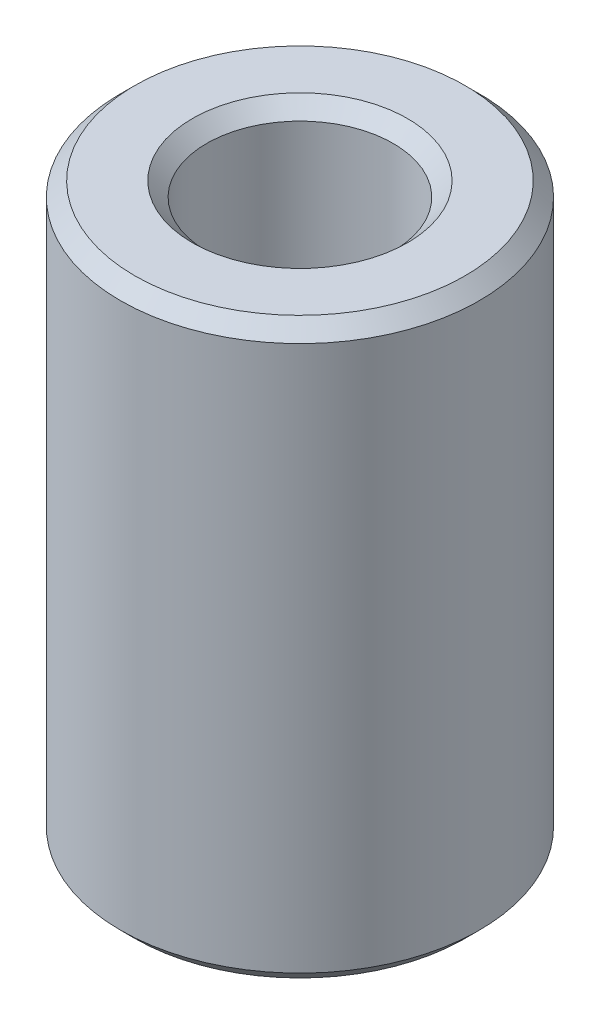
ISO-10303-21;
HEADER;
FILE_DESCRIPTION(('STEP AP214'),'2;1');
FILE_NAME('part.step','',(''),(''),'','','');
FILE_SCHEMA(('AUTOMOTIVE_DESIGN { 1 0 10303 214 1 1 1 1 }'));
ENDSEC;
DATA;
#1=APPLICATION_CONTEXT('core data for automotive mechanical design processes');
#2=APPLICATION_PROTOCOL_DEFINITION('international standard','automotive_design',2000,#1);
#3=PRODUCT_CONTEXT('',#1,'mechanical');
#4=PRODUCT('Part','Part','',(#3));
#5=PRODUCT_RELATED_PRODUCT_CATEGORY('part','',(#4));
#6=PRODUCT_DEFINITION_FORMATION('','',#4);
#7=PRODUCT_DEFINITION_CONTEXT('part definition',#1,'design');
#8=PRODUCT_DEFINITION('design','',#6,#7);
#9=PRODUCT_DEFINITION_SHAPE('','',#8);
#10=(LENGTH_UNIT() NAMED_UNIT(*) SI_UNIT(.MILLI.,.METRE.));
#11=(NAMED_UNIT(*) PLANE_ANGLE_UNIT() SI_UNIT($,.RADIAN.));
#12=(NAMED_UNIT(*) SI_UNIT($,.STERADIAN.) SOLID_ANGLE_UNIT());
#13=UNCERTAINTY_MEASURE_WITH_UNIT(LENGTH_MEASURE(1.E-05),#10,'distance_accuracy_value','');
#14=(GEOMETRIC_REPRESENTATION_CONTEXT(3) GLOBAL_UNCERTAINTY_ASSIGNED_CONTEXT((#13)) GLOBAL_UNIT_ASSIGNED_CONTEXT((#10,
#11,#12)) REPRESENTATION_CONTEXT('',''));
#15=CARTESIAN_POINT('',(0.,0.,0.));
#16=DIRECTION('',(0.,0.,1.));
#17=DIRECTION('',(1.,0.,0.));
#18=AXIS2_PLACEMENT_3D('',#15,#16,#17);
#19=CARTESIAN_POINT('',(0.,8.,0.));
#20=DIRECTION('',(0.,1.,0.));
#21=DIRECTION('',(0.,0.,1.));
#22=AXIS2_PLACEMENT_3D('',#19,#20,#21);
#23=PLANE('',#22);
#24=CARTESIAN_POINT('',(0.,8.,0.));
#25=DIRECTION('',(0.,1.,0.));
#26=DIRECTION('',(0.,0.,1.));
#27=AXIS2_PLACEMENT_3D('',#24,#25,#26);
#28=CIRCLE('',#27,2.3);
#29=CARTESIAN_POINT('',(0.,8.,2.3));
#30=VERTEX_POINT('',#29);
#31=EDGE_CURVE('E10',#30,#30,#28,.T.);
#32=ORIENTED_EDGE('',*,*,#31,.T.);
#33=EDGE_LOOP('',(#32));
#34=FACE_BOUND('',#33,.T.);
#35=CARTESIAN_POINT('',(0.,8.,0.));
#36=DIRECTION('',(0.,1.,0.));
#37=DIRECTION('',(0.,0.,1.));
#38=AXIS2_PLACEMENT_3D('',#35,#36,#37);
#39=CIRCLE('',#38,1.5);
#40=CARTESIAN_POINT('',(0.,8.,1.5));
#41=VERTEX_POINT('',#40);
#42=EDGE_CURVE('E44',#41,#41,#39,.F.);
#43=ORIENTED_EDGE('',*,*,#42,.T.);
#44=EDGE_LOOP('',(#43));
#45=FACE_BOUND('',#44,.T.);
#46=ADVANCED_FACE('F37',(#34,#45),#23,.T.);
#47=CARTESIAN_POINT('',(0.,0.,0.));
#48=DIRECTION('',(0.,1.,0.));
#49=DIRECTION('',(0.,0.,1.));
#50=AXIS2_PLACEMENT_3D('',#47,#48,#49);
#51=PLANE('',#50);
#52=CARTESIAN_POINT('',(0.,0.,0.));
#53=DIRECTION('',(0.,1.,0.));
#54=DIRECTION('',(0.,0.,1.));
#55=AXIS2_PLACEMENT_3D('',#52,#53,#54);
#56=CIRCLE('',#55,2.3);
#57=CARTESIAN_POINT('',(0.,0.,2.3));
#58=VERTEX_POINT('',#57);
#59=EDGE_CURVE('E57',#58,#58,#56,.F.);
#60=ORIENTED_EDGE('',*,*,#59,.T.);
#61=EDGE_LOOP('',(#60));
#62=FACE_BOUND('',#61,.T.);
#63=CARTESIAN_POINT('',(0.,0.,0.));
#64=DIRECTION('',(0.,1.,0.));
#65=DIRECTION('',(0.,0.,1.));
#66=AXIS2_PLACEMENT_3D('',#63,#64,#65);
#67=CIRCLE('',#66,1.5);
#68=CARTESIAN_POINT('',(0.,0.,1.5));
#69=VERTEX_POINT('',#68);
#70=EDGE_CURVE('E60',#69,#69,#67,.T.);
#71=ORIENTED_EDGE('',*,*,#70,.T.);
#72=EDGE_LOOP('',(#71));
#73=FACE_BOUND('',#72,.T.);
#74=ADVANCED_FACE('F85',(#62,#73),#51,.F.);
#75=CARTESIAN_POINT('',(0.,8.,0.));
#76=DIRECTION('',(0.,-1.,0.));
#77=DIRECTION('',(0.,0.,-1.));
#78=AXIS2_PLACEMENT_3D('',#75,#76,#77);
#79=CYLINDRICAL_SURFACE('',#78,2.5);
#80=CARTESIAN_POINT('',(0.,0.200000000000001,0.));
#81=DIRECTION('',(0.,1.,0.));
#82=DIRECTION('',(0.,0.,1.));
#83=AXIS2_PLACEMENT_3D('',#80,#81,#82);
#84=CIRCLE('',#83,2.5);
#85=CARTESIAN_POINT('',(0.,0.200000000000001,2.5));
#86=VERTEX_POINT('',#85);
#87=EDGE_CURVE('E63',#86,#86,#84,.T.);
#88=ORIENTED_EDGE('',*,*,#87,.T.);
#89=EDGE_LOOP('',(#88));
#90=FACE_BOUND('',#89,.T.);
#91=CARTESIAN_POINT('',(0.,7.8,0.));
#92=DIRECTION('',(0.,1.,0.));
#93=DIRECTION('',(0.,0.,1.));
#94=AXIS2_PLACEMENT_3D('',#91,#92,#93);
#95=CIRCLE('',#94,2.5);
#96=CARTESIAN_POINT('',(0.,7.8,2.5));
#97=VERTEX_POINT('',#96);
#98=EDGE_CURVE('E66',#97,#97,#95,.F.);
#99=ORIENTED_EDGE('',*,*,#98,.T.);
#100=EDGE_LOOP('',(#99));
#101=FACE_BOUND('',#100,.T.);
#102=ADVANCED_FACE('F70',(#90,#101),#79,.T.);
#103=CARTESIAN_POINT('',(0.,8.,0.));
#104=DIRECTION('',(0.,-1.,0.));
#105=DIRECTION('',(0.,0.,-1.));
#106=AXIS2_PLACEMENT_3D('',#103,#104,#105);
#107=CYLINDRICAL_SURFACE('',#106,1.3);
#108=CARTESIAN_POINT('',(0.,0.200000000000001,0.));
#109=DIRECTION('',(0.,1.,0.));
#110=DIRECTION('',(0.,0.,1.));
#111=AXIS2_PLACEMENT_3D('',#108,#109,#110);
#112=CIRCLE('',#111,1.3);
#113=CARTESIAN_POINT('',(0.,0.200000000000001,1.3));
#114=VERTEX_POINT('',#113);
#115=EDGE_CURVE('E48',#114,#114,#112,.F.);
#116=ORIENTED_EDGE('',*,*,#115,.T.);
#117=EDGE_LOOP('',(#116));
#118=FACE_BOUND('',#117,.T.);
#119=CARTESIAN_POINT('',(0.,7.8,0.));
#120=DIRECTION('',(0.,1.,0.));
#121=DIRECTION('',(0.,0.,1.));
#122=AXIS2_PLACEMENT_3D('',#119,#120,#121);
#123=CIRCLE('',#122,1.3);
#124=CARTESIAN_POINT('',(0.,7.8,1.3));
#125=VERTEX_POINT('',#124);
#126=EDGE_CURVE('E52',#125,#125,#123,.T.);
#127=ORIENTED_EDGE('',*,*,#126,.T.);
#128=EDGE_LOOP('',(#127));
#129=FACE_BOUND('',#128,.T.);
#130=ADVANCED_FACE('F93',(#118,#129),#107,.F.);
#131=CARTESIAN_POINT('',(0.,0.200000000000001,0.));
#132=DIRECTION('',(0.,1.,0.));
#133=DIRECTION('',(0.,0.,1.));
#134=AXIS2_PLACEMENT_3D('',#131,#132,#133);
#135=CONICAL_SURFACE('',#134,2.5,0.785398163397452);
#136=ORIENTED_EDGE('',*,*,#59,.F.);
#137=EDGE_LOOP('',(#136));
#138=FACE_BOUND('',#137,.T.);
#139=ORIENTED_EDGE('',*,*,#87,.F.);
#140=EDGE_LOOP('',(#139));
#141=FACE_BOUND('',#140,.T.);
#142=ADVANCED_FACE('F81',(#138,#141),#135,.T.);
#143=CARTESIAN_POINT('',(0.,0.,0.));
#144=DIRECTION('',(0.,-1.,0.));
#145=DIRECTION('',(0.,0.,-1.));
#146=AXIS2_PLACEMENT_3D('',#143,#144,#145);
#147=CONICAL_SURFACE('',#146,1.5,0.785398163397446);
#148=ORIENTED_EDGE('',*,*,#115,.F.);
#149=EDGE_LOOP('',(#148));
#150=FACE_BOUND('',#149,.T.);
#151=ORIENTED_EDGE('',*,*,#70,.F.);
#152=EDGE_LOOP('',(#151));
#153=FACE_BOUND('',#152,.T.);
#154=ADVANCED_FACE('F75',(#150,#153),#147,.F.);
#155=CARTESIAN_POINT('',(0.,8.,0.));
#156=DIRECTION('',(0.,-1.,0.));
#157=DIRECTION('',(0.,0.,-1.));
#158=AXIS2_PLACEMENT_3D('',#155,#156,#157);
#159=CONICAL_SURFACE('',#158,2.3,0.785398163397445);
#160=ORIENTED_EDGE('',*,*,#98,.F.);
#161=EDGE_LOOP('',(#160));
#162=FACE_BOUND('',#161,.T.);
#163=ORIENTED_EDGE('',*,*,#31,.F.);
#164=EDGE_LOOP('',(#163));
#165=FACE_BOUND('',#164,.T.);
#166=ADVANCED_FACE('F72',(#162,#165),#159,.T.);
#167=CARTESIAN_POINT('',(0.,7.8,0.));
#168=DIRECTION('',(0.,1.,0.));
#169=DIRECTION('',(0.,0.,1.));
#170=AXIS2_PLACEMENT_3D('',#167,#168,#169);
#171=CONICAL_SURFACE('',#170,1.3,0.785398163397442);
#172=ORIENTED_EDGE('',*,*,#42,.F.);
#173=EDGE_LOOP('',(#172));
#174=FACE_BOUND('',#173,.T.);
#175=ORIENTED_EDGE('',*,*,#126,.F.);
#176=EDGE_LOOP('',(#175));
#177=FACE_BOUND('',#176,.T.);
#178=ADVANCED_FACE('F39',(#174,#177),#171,.F.);
#179=CLOSED_SHELL('',(#46,#74,#102,#130,#142,#154,#166,#178));
#180=MANIFOLD_SOLID_BREP('B2',#179);
#181=ADVANCED_BREP_SHAPE_REPRESENTATION('',(#18,#180),#14);
#182=SHAPE_DEFINITION_REPRESENTATION(#9,#181);
ENDSEC;
END-ISO-10303-21;
